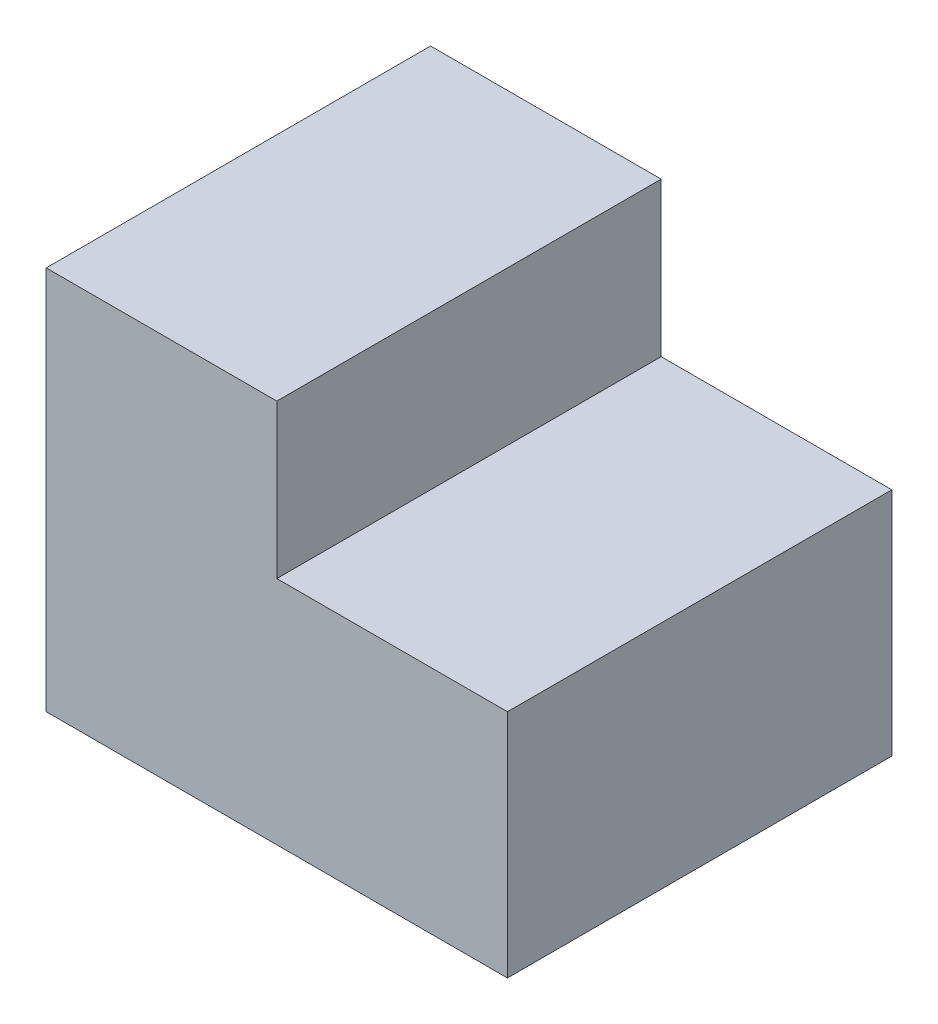
ISO-10303-21;
HEADER;
FILE_DESCRIPTION(('STEP AP214'),'2;1');
FILE_NAME('part.step','',(''),(''),'','','');
FILE_SCHEMA(('AUTOMOTIVE_DESIGN { 1 0 10303 214 1 1 1 1 }'));
ENDSEC;
DATA;
#1=APPLICATION_CONTEXT('core data for automotive mechanical design processes');
#2=APPLICATION_PROTOCOL_DEFINITION('international standard','automotive_design',2000,#1);
#3=PRODUCT_CONTEXT('',#1,'mechanical');
#4=PRODUCT('Part','Part','',(#3));
#5=PRODUCT_RELATED_PRODUCT_CATEGORY('part','',(#4));
#6=PRODUCT_DEFINITION_FORMATION('','',#4);
#7=PRODUCT_DEFINITION_CONTEXT('part definition',#1,'design');
#8=PRODUCT_DEFINITION('design','',#6,#7);
#9=PRODUCT_DEFINITION_SHAPE('','',#8);
#10=(LENGTH_UNIT() NAMED_UNIT(*) SI_UNIT(.MILLI.,.METRE.));
#11=(NAMED_UNIT(*) PLANE_ANGLE_UNIT() SI_UNIT($,.RADIAN.));
#12=(NAMED_UNIT(*) SI_UNIT($,.STERADIAN.) SOLID_ANGLE_UNIT());
#13=UNCERTAINTY_MEASURE_WITH_UNIT(LENGTH_MEASURE(1.E-05),#10,'distance_accuracy_value','');
#14=(GEOMETRIC_REPRESENTATION_CONTEXT(3) GLOBAL_UNCERTAINTY_ASSIGNED_CONTEXT((#13)) GLOBAL_UNIT_ASSIGNED_CONTEXT((#10,
#11,#12)) REPRESENTATION_CONTEXT('',''));
#15=CARTESIAN_POINT('',(0.,0.,0.));
#16=DIRECTION('',(0.,0.,1.));
#17=DIRECTION('',(1.,0.,0.));
#18=AXIS2_PLACEMENT_3D('',#15,#16,#17);
#19=CARTESIAN_POINT('',(-30.,0.,25.));
#20=DIRECTION('',(1.,0.,0.));
#21=DIRECTION('',(0.,0.,-1.));
#22=AXIS2_PLACEMENT_3D('',#19,#20,#21);
#23=PLANE('',#22);
#24=DIRECTION('',(0.,-1.,0.));
#25=VECTOR('',#24,1.);
#26=CARTESIAN_POINT('',(-30.,0.,0.));
#27=LINE('',#26,#25);
#28=CARTESIAN_POINT('',(-30.,25.,0.));
#29=VERTEX_POINT('',#28);
#30=CARTESIAN_POINT('',(-30.,0.,0.));
#31=VERTEX_POINT('',#30);
#32=EDGE_CURVE('E117',#29,#31,#27,.T.);
#33=ORIENTED_EDGE('',*,*,#32,.T.);
#34=DIRECTION('',(0.,0.,-1.));
#35=VECTOR('',#34,1.);
#36=CARTESIAN_POINT('',(-30.,0.,25.));
#37=LINE('',#36,#35);
#38=CARTESIAN_POINT('',(-30.,0.,25.));
#39=VERTEX_POINT('',#38);
#40=EDGE_CURVE('E11',#39,#31,#37,.T.);
#41=ORIENTED_EDGE('',*,*,#40,.F.);
#42=DIRECTION('',(0.,-1.,0.));
#43=VECTOR('',#42,1.);
#44=CARTESIAN_POINT('',(-30.,0.,25.));
#45=LINE('',#44,#43);
#46=CARTESIAN_POINT('',(-30.,25.,25.));
#47=VERTEX_POINT('',#46);
#48=EDGE_CURVE('E127',#47,#39,#45,.T.);
#49=ORIENTED_EDGE('',*,*,#48,.F.);
#50=DIRECTION('',(0.,0.,-1.));
#51=VECTOR('',#50,1.);
#52=CARTESIAN_POINT('',(-30.,25.,25.));
#53=LINE('',#52,#51);
#54=EDGE_CURVE('E113',#47,#29,#53,.T.);
#55=ORIENTED_EDGE('',*,*,#54,.T.);
#56=EDGE_LOOP('',(#33,#41,#49,#55));
#57=FACE_BOUND('',#56,.T.);
#58=ADVANCED_FACE('F33',(#57),#23,.F.);
#59=CARTESIAN_POINT('',(0.,0.,25.));
#60=DIRECTION('',(0.,1.,0.));
#61=DIRECTION('',(-1.,0.,0.));
#62=AXIS2_PLACEMENT_3D('',#59,#60,#61);
#63=PLANE('',#62);
#64=DIRECTION('',(1.,0.,0.));
#65=VECTOR('',#64,1.);
#66=CARTESIAN_POINT('',(0.,0.,0.));
#67=LINE('',#66,#65);
#68=CARTESIAN_POINT('',(0.,0.,0.));
#69=VERTEX_POINT('',#68);
#70=EDGE_CURVE('E120',#31,#69,#67,.T.);
#71=ORIENTED_EDGE('',*,*,#70,.T.);
#72=DIRECTION('',(0.,0.,-1.));
#73=VECTOR('',#72,1.);
#74=CARTESIAN_POINT('',(0.,0.,25.));
#75=LINE('',#74,#73);
#76=CARTESIAN_POINT('',(0.,0.,25.));
#77=VERTEX_POINT('',#76);
#78=EDGE_CURVE('E41',#77,#69,#75,.T.);
#79=ORIENTED_EDGE('',*,*,#78,.F.);
#80=DIRECTION('',(1.,0.,0.));
#81=VECTOR('',#80,1.);
#82=CARTESIAN_POINT('',(0.,0.,25.));
#83=LINE('',#82,#81);
#84=EDGE_CURVE('E86',#39,#77,#83,.T.);
#85=ORIENTED_EDGE('',*,*,#84,.F.);
#86=ORIENTED_EDGE('',*,*,#40,.T.);
#87=EDGE_LOOP('',(#71,#79,#85,#86));
#88=FACE_BOUND('',#87,.T.);
#89=ADVANCED_FACE('F151',(#88),#63,.F.);
#90=CARTESIAN_POINT('',(0.,15.,25.));
#91=DIRECTION('',(-1.,0.,0.));
#92=DIRECTION('',(0.,0.,1.));
#93=AXIS2_PLACEMENT_3D('',#90,#91,#92);
#94=PLANE('',#93);
#95=DIRECTION('',(0.,1.,0.));
#96=VECTOR('',#95,1.);
#97=CARTESIAN_POINT('',(0.,15.,0.));
#98=LINE('',#97,#96);
#99=CARTESIAN_POINT('',(0.,15.,0.));
#100=VERTEX_POINT('',#99);
#101=EDGE_CURVE('E122',#69,#100,#98,.T.);
#102=ORIENTED_EDGE('',*,*,#101,.T.);
#103=DIRECTION('',(0.,0.,-1.));
#104=VECTOR('',#103,1.);
#105=CARTESIAN_POINT('',(0.,15.,25.));
#106=LINE('',#105,#104);
#107=CARTESIAN_POINT('',(0.,15.,25.));
#108=VERTEX_POINT('',#107);
#109=EDGE_CURVE('E108',#108,#100,#106,.T.);
#110=ORIENTED_EDGE('',*,*,#109,.F.);
#111=DIRECTION('',(0.,1.,0.));
#112=VECTOR('',#111,1.);
#113=CARTESIAN_POINT('',(0.,15.,25.));
#114=LINE('',#113,#112);
#115=EDGE_CURVE('E99',#77,#108,#114,.T.);
#116=ORIENTED_EDGE('',*,*,#115,.F.);
#117=ORIENTED_EDGE('',*,*,#78,.T.);
#118=EDGE_LOOP('',(#102,#110,#116,#117));
#119=FACE_BOUND('',#118,.T.);
#120=ADVANCED_FACE('F133',(#119),#94,.F.);
#121=CARTESIAN_POINT('',(-15.,15.,25.));
#122=DIRECTION('',(0.,-1.,0.));
#123=DIRECTION('',(1.,0.,0.));
#124=AXIS2_PLACEMENT_3D('',#121,#122,#123);
#125=PLANE('',#124);
#126=DIRECTION('',(-1.,0.,0.));
#127=VECTOR('',#126,1.);
#128=CARTESIAN_POINT('',(-15.,15.,0.));
#129=LINE('',#128,#127);
#130=CARTESIAN_POINT('',(-15.,15.,0.));
#131=VERTEX_POINT('',#130);
#132=EDGE_CURVE('E107',#100,#131,#129,.T.);
#133=ORIENTED_EDGE('',*,*,#132,.T.);
#134=DIRECTION('',(0.,0.,-1.));
#135=VECTOR('',#134,1.);
#136=CARTESIAN_POINT('',(-15.,15.,25.));
#137=LINE('',#136,#135);
#138=CARTESIAN_POINT('',(-15.,15.,25.));
#139=VERTEX_POINT('',#138);
#140=EDGE_CURVE('E104',#139,#131,#137,.T.);
#141=ORIENTED_EDGE('',*,*,#140,.F.);
#142=DIRECTION('',(-1.,0.,0.));
#143=VECTOR('',#142,1.);
#144=CARTESIAN_POINT('',(-15.,15.,25.));
#145=LINE('',#144,#143);
#146=EDGE_CURVE('E93',#108,#139,#145,.T.);
#147=ORIENTED_EDGE('',*,*,#146,.F.);
#148=ORIENTED_EDGE('',*,*,#109,.T.);
#149=EDGE_LOOP('',(#133,#141,#147,#148));
#150=FACE_BOUND('',#149,.T.);
#151=ADVANCED_FACE('F105',(#150),#125,.F.);
#152=CARTESIAN_POINT('',(-15.,25.,25.));
#153=DIRECTION('',(-1.,0.,0.));
#154=DIRECTION('',(0.,0.,1.));
#155=AXIS2_PLACEMENT_3D('',#152,#153,#154);
#156=PLANE('',#155);
#157=DIRECTION('',(0.,1.,0.));
#158=VECTOR('',#157,1.);
#159=CARTESIAN_POINT('',(-15.,25.,0.));
#160=LINE('',#159,#158);
#161=CARTESIAN_POINT('',(-15.,25.,0.));
#162=VERTEX_POINT('',#161);
#163=EDGE_CURVE('E72',#131,#162,#160,.T.);
#164=ORIENTED_EDGE('',*,*,#163,.T.);
#165=DIRECTION('',(0.,0.,-1.));
#166=VECTOR('',#165,1.);
#167=CARTESIAN_POINT('',(-15.,25.,25.));
#168=LINE('',#167,#166);
#169=CARTESIAN_POINT('',(-15.,25.,25.));
#170=VERTEX_POINT('',#169);
#171=EDGE_CURVE('E109',#170,#162,#168,.T.);
#172=ORIENTED_EDGE('',*,*,#171,.F.);
#173=DIRECTION('',(0.,1.,0.));
#174=VECTOR('',#173,1.);
#175=CARTESIAN_POINT('',(-15.,25.,25.));
#176=LINE('',#175,#174);
#177=EDGE_CURVE('E97',#139,#170,#176,.T.);
#178=ORIENTED_EDGE('',*,*,#177,.F.);
#179=ORIENTED_EDGE('',*,*,#140,.T.);
#180=EDGE_LOOP('',(#164,#172,#178,#179));
#181=FACE_BOUND('',#180,.T.);
#182=ADVANCED_FACE('F111',(#181),#156,.F.);
#183=CARTESIAN_POINT('',(-30.,25.,25.));
#184=DIRECTION('',(0.,-1.,0.));
#185=DIRECTION('',(1.,0.,0.));
#186=AXIS2_PLACEMENT_3D('',#183,#184,#185);
#187=PLANE('',#186);
#188=DIRECTION('',(-1.,0.,0.));
#189=VECTOR('',#188,1.);
#190=CARTESIAN_POINT('',(-30.,25.,0.));
#191=LINE('',#190,#189);
#192=EDGE_CURVE('E78',#162,#29,#191,.T.);
#193=ORIENTED_EDGE('',*,*,#192,.T.);
#194=ORIENTED_EDGE('',*,*,#54,.F.);
#195=DIRECTION('',(-1.,0.,0.));
#196=VECTOR('',#195,1.);
#197=CARTESIAN_POINT('',(-30.,25.,25.));
#198=LINE('',#197,#196);
#199=EDGE_CURVE('E49',#170,#47,#198,.T.);
#200=ORIENTED_EDGE('',*,*,#199,.F.);
#201=ORIENTED_EDGE('',*,*,#171,.T.);
#202=EDGE_LOOP('',(#193,#194,#200,#201));
#203=FACE_BOUND('',#202,.T.);
#204=ADVANCED_FACE('F140',(#203),#187,.F.);
#205=CARTESIAN_POINT('',(0.,0.,25.));
#206=DIRECTION('',(0.,0.,-1.));
#207=DIRECTION('',(-1.,0.,0.));
#208=AXIS2_PLACEMENT_3D('',#205,#206,#207);
#209=PLANE('',#208);
#210=ORIENTED_EDGE('',*,*,#48,.T.);
#211=ORIENTED_EDGE('',*,*,#84,.T.);
#212=ORIENTED_EDGE('',*,*,#115,.T.);
#213=ORIENTED_EDGE('',*,*,#146,.T.);
#214=ORIENTED_EDGE('',*,*,#177,.T.);
#215=ORIENTED_EDGE('',*,*,#199,.T.);
#216=EDGE_LOOP('',(#210,#211,#212,#213,#214,#215));
#217=FACE_BOUND('',#216,.T.);
#218=ADVANCED_FACE('F95',(#217),#209,.F.);
#219=CARTESIAN_POINT('',(0.,0.,0.));
#220=DIRECTION('',(0.,0.,-1.));
#221=DIRECTION('',(-1.,0.,0.));
#222=AXIS2_PLACEMENT_3D('',#219,#220,#221);
#223=PLANE('',#222);
#224=ORIENTED_EDGE('',*,*,#32,.F.);
#225=ORIENTED_EDGE('',*,*,#192,.F.);
#226=ORIENTED_EDGE('',*,*,#163,.F.);
#227=ORIENTED_EDGE('',*,*,#132,.F.);
#228=ORIENTED_EDGE('',*,*,#101,.F.);
#229=ORIENTED_EDGE('',*,*,#70,.F.);
#230=EDGE_LOOP('',(#224,#225,#226,#227,#228,#229));
#231=FACE_BOUND('',#230,.T.);
#232=ADVANCED_FACE('F136',(#231),#223,.T.);
#233=CLOSED_SHELL('',(#58,#89,#120,#151,#182,#204,#218,#232));
#234=MANIFOLD_SOLID_BREP('B2',#233);
#235=ADVANCED_BREP_SHAPE_REPRESENTATION('',(#18,#234),#14);
#236=SHAPE_DEFINITION_REPRESENTATION(#9,#235);
ENDSEC;
END-ISO-10303-21;
